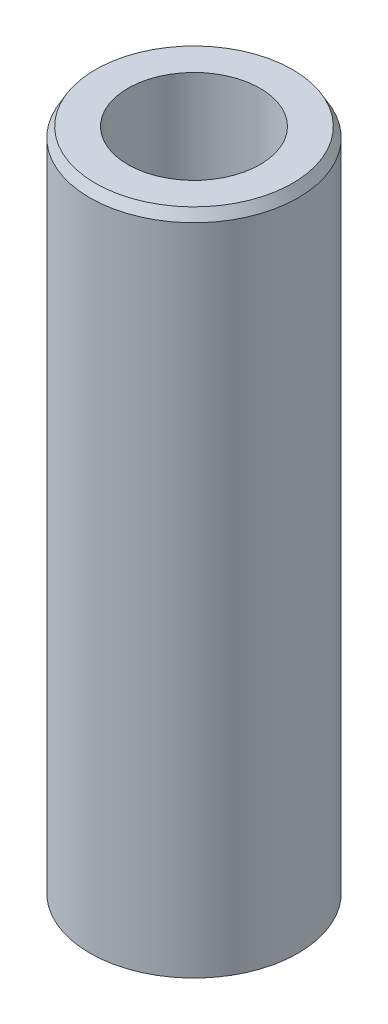
ISO-10303-21;
HEADER;
FILE_DESCRIPTION(('STEP AP214'),'2;1');
FILE_NAME('part.step','',(''),(''),'','','');
FILE_SCHEMA(('AUTOMOTIVE_DESIGN { 1 0 10303 214 1 1 1 1 }'));
ENDSEC;
DATA;
#1=APPLICATION_CONTEXT('core data for automotive mechanical design processes');
#2=APPLICATION_PROTOCOL_DEFINITION('international standard','automotive_design',2000,#1);
#3=PRODUCT_CONTEXT('',#1,'mechanical');
#4=PRODUCT('Part','Part','',(#3));
#5=PRODUCT_RELATED_PRODUCT_CATEGORY('part','',(#4));
#6=PRODUCT_DEFINITION_FORMATION('','',#4);
#7=PRODUCT_DEFINITION_CONTEXT('part definition',#1,'design');
#8=PRODUCT_DEFINITION('design','',#6,#7);
#9=PRODUCT_DEFINITION_SHAPE('','',#8);
#10=(LENGTH_UNIT() NAMED_UNIT(*) SI_UNIT(.MILLI.,.METRE.));
#11=(NAMED_UNIT(*) PLANE_ANGLE_UNIT() SI_UNIT($,.RADIAN.));
#12=(NAMED_UNIT(*) SI_UNIT($,.STERADIAN.) SOLID_ANGLE_UNIT());
#13=UNCERTAINTY_MEASURE_WITH_UNIT(LENGTH_MEASURE(1.E-05),#10,'distance_accuracy_value','');
#14=(GEOMETRIC_REPRESENTATION_CONTEXT(3) GLOBAL_UNCERTAINTY_ASSIGNED_CONTEXT((#13)) GLOBAL_UNIT_ASSIGNED_CONTEXT((#10,
#11,#12)) REPRESENTATION_CONTEXT('',''));
#15=CARTESIAN_POINT('',(0.,0.,0.));
#16=DIRECTION('',(0.,0.,1.));
#17=DIRECTION('',(1.,0.,0.));
#18=AXIS2_PLACEMENT_3D('',#15,#16,#17);
#19=CARTESIAN_POINT('',(0.,305.404143278473,0.));
#20=DIRECTION('',(0.,-1.,0.));
#21=DIRECTION('',(0.,0.,-1.));
#22=AXIS2_PLACEMENT_3D('',#19,#20,#21);
#23=CYLINDRICAL_SURFACE('',#22,47.5);
#24=CARTESIAN_POINT('',(0.,300.936077569511,0.));
#25=DIRECTION('',(0.,1.,0.));
#26=DIRECTION('',(0.,0.,1.));
#27=AXIS2_PLACEMENT_3D('',#24,#25,#26);
#28=CIRCLE('',#27,47.5);
#29=CARTESIAN_POINT('',(0.,300.936077569511,47.5));
#30=VERTEX_POINT('',#29);
#31=EDGE_CURVE('E50',#30,#30,#28,.F.);
#32=ORIENTED_EDGE('',*,*,#31,.T.);
#33=EDGE_LOOP('',(#32));
#34=FACE_BOUND('',#33,.T.);
#35=CARTESIAN_POINT('',(0.,2.55000792923743,0.));
#36=DIRECTION('',(0.,1.,0.));
#37=DIRECTION('',(0.,0.,1.));
#38=AXIS2_PLACEMENT_3D('',#35,#36,#37);
#39=CIRCLE('',#38,47.5);
#40=CARTESIAN_POINT('',(0.,2.55000792923743,47.5));
#41=VERTEX_POINT('',#40);
#42=EDGE_CURVE('E51',#41,#41,#39,.T.);
#43=ORIENTED_EDGE('',*,*,#42,.T.);
#44=EDGE_LOOP('',(#43));
#45=FACE_BOUND('',#44,.T.);
#46=ADVANCED_FACE('F39',(#34,#45),#23,.T.);
#47=CARTESIAN_POINT('',(0.,305.404143278473,0.));
#48=DIRECTION('',(0.,1.,0.));
#49=DIRECTION('',(0.,0.,1.));
#50=AXIS2_PLACEMENT_3D('',#47,#48,#49);
#51=PLANE('',#50);
#52=CARTESIAN_POINT('',(0.,305.404143278473,0.));
#53=DIRECTION('',(0.,1.,0.));
#54=DIRECTION('',(0.,0.,1.));
#55=AXIS2_PLACEMENT_3D('',#52,#53,#54);
#56=CIRCLE('',#55,44.9499920707626);
#57=CARTESIAN_POINT('',(0.,305.404143278473,44.9499920707626));
#58=VERTEX_POINT('',#57);
#59=EDGE_CURVE('E54',#58,#58,#56,.T.);
#60=ORIENTED_EDGE('',*,*,#59,.T.);
#61=EDGE_LOOP('',(#60));
#62=FACE_BOUND('',#61,.T.);
#63=CARTESIAN_POINT('',(0.,305.404143278473,0.));
#64=DIRECTION('',(0.,1.,0.));
#65=DIRECTION('',(0.,0.,1.));
#66=AXIS2_PLACEMENT_3D('',#63,#64,#65);
#67=CIRCLE('',#66,30.1630018061996);
#68=CARTESIAN_POINT('',(0.,305.404143278473,30.1630018061996));
#69=VERTEX_POINT('',#68);
#70=EDGE_CURVE('E58',#69,#69,#67,.T.);
#71=ORIENTED_EDGE('',*,*,#70,.F.);
#72=EDGE_LOOP('',(#71));
#73=FACE_BOUND('',#72,.T.);
#74=ADVANCED_FACE('F69',(#62,#73),#51,.T.);
#75=CARTESIAN_POINT('',(0.,0.,0.));
#76=DIRECTION('',(0.,1.,0.));
#77=DIRECTION('',(0.,0.,1.));
#78=AXIS2_PLACEMENT_3D('',#75,#76,#77);
#79=PLANE('',#78);
#80=CARTESIAN_POINT('',(0.,0.,0.));
#81=DIRECTION('',(0.,1.,0.));
#82=DIRECTION('',(0.,0.,1.));
#83=AXIS2_PLACEMENT_3D('',#80,#81,#82);
#84=CIRCLE('',#83,43.0319342910383);
#85=CARTESIAN_POINT('',(0.,0.,43.0319342910383));
#86=VERTEX_POINT('',#85);
#87=EDGE_CURVE('E10',#86,#86,#84,.F.);
#88=ORIENTED_EDGE('',*,*,#87,.T.);
#89=EDGE_LOOP('',(#88));
#90=FACE_BOUND('',#89,.T.);
#91=CARTESIAN_POINT('',(0.,0.,0.));
#92=DIRECTION('',(0.,1.,0.));
#93=DIRECTION('',(0.,0.,1.));
#94=AXIS2_PLACEMENT_3D('',#91,#92,#93);
#95=CIRCLE('',#94,30.1630018061996);
#96=CARTESIAN_POINT('',(0.,0.,30.1630018061996));
#97=VERTEX_POINT('',#96);
#98=EDGE_CURVE('E63',#97,#97,#95,.T.);
#99=ORIENTED_EDGE('',*,*,#98,.T.);
#100=EDGE_LOOP('',(#99));
#101=FACE_BOUND('',#100,.T.);
#102=ADVANCED_FACE('F75',(#90,#101),#79,.F.);
#103=CARTESIAN_POINT('',(0.,305.404143278473,0.));
#104=DIRECTION('',(0.,-1.,0.));
#105=DIRECTION('',(0.,0.,-1.));
#106=AXIS2_PLACEMENT_3D('',#103,#104,#105);
#107=CYLINDRICAL_SURFACE('',#106,30.1630018061996);
#108=ORIENTED_EDGE('',*,*,#70,.T.);
#109=EDGE_LOOP('',(#108));
#110=FACE_BOUND('',#109,.T.);
#111=ORIENTED_EDGE('',*,*,#98,.F.);
#112=EDGE_LOOP('',(#111));
#113=FACE_BOUND('',#112,.T.);
#114=ADVANCED_FACE('F70',(#110,#113),#107,.F.);
#115=CARTESIAN_POINT('',(0.,305.404143278473,0.));
#116=DIRECTION('',(0.,-1.,0.));
#117=DIRECTION('',(0.,0.,-1.));
#118=AXIS2_PLACEMENT_3D('',#115,#116,#117);
#119=CONICAL_SURFACE('',#118,44.9499920707626,0.51861069458678);
#120=ORIENTED_EDGE('',*,*,#31,.F.);
#121=EDGE_LOOP('',(#120));
#122=FACE_BOUND('',#121,.T.);
#123=ORIENTED_EDGE('',*,*,#59,.F.);
#124=EDGE_LOOP('',(#123));
#125=FACE_BOUND('',#124,.T.);
#126=ADVANCED_FACE('F81',(#122,#125),#119,.T.);
#127=CARTESIAN_POINT('',(0.,2.55000792923743,0.));
#128=DIRECTION('',(0.,1.,0.));
#129=DIRECTION('',(0.,0.,1.));
#130=AXIS2_PLACEMENT_3D('',#127,#128,#129);
#131=CONICAL_SURFACE('',#130,47.5,1.05218563220812);
#132=ORIENTED_EDGE('',*,*,#87,.F.);
#133=EDGE_LOOP('',(#132));
#134=FACE_BOUND('',#133,.T.);
#135=ORIENTED_EDGE('',*,*,#42,.F.);
#136=EDGE_LOOP('',(#135));
#137=FACE_BOUND('',#136,.T.);
#138=ADVANCED_FACE('F45',(#134,#137),#131,.T.);
#139=CLOSED_SHELL('',(#46,#74,#102,#114,#126,#138));
#140=MANIFOLD_SOLID_BREP('B2',#139);
#141=ADVANCED_BREP_SHAPE_REPRESENTATION('',(#18,#140),#14);
#142=SHAPE_DEFINITION_REPRESENTATION(#9,#141);
ENDSEC;
END-ISO-10303-21;
